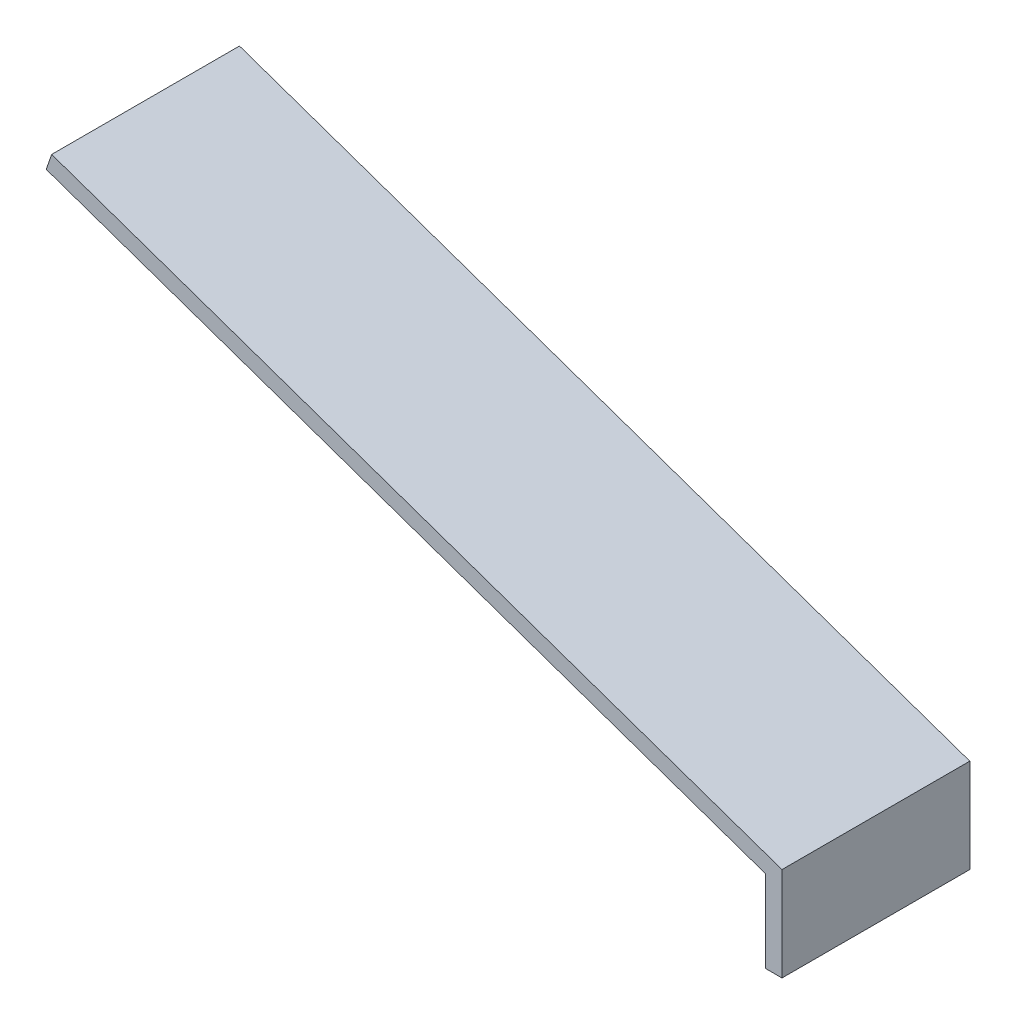
ISO-10303-21;
HEADER;
FILE_DESCRIPTION(('STEP AP214'),'2;1');
FILE_NAME('part.step','',(''),(''),'','','');
FILE_SCHEMA(('AUTOMOTIVE_DESIGN { 1 0 10303 214 1 1 1 1 }'));
ENDSEC;
DATA;
#1=APPLICATION_CONTEXT('core data for automotive mechanical design processes');
#2=APPLICATION_PROTOCOL_DEFINITION('international standard','automotive_design',2000,#1);
#3=PRODUCT_CONTEXT('',#1,'mechanical');
#4=PRODUCT('Part','Part','',(#3));
#5=PRODUCT_RELATED_PRODUCT_CATEGORY('part','',(#4));
#6=PRODUCT_DEFINITION_FORMATION('','',#4);
#7=PRODUCT_DEFINITION_CONTEXT('part definition',#1,'design');
#8=PRODUCT_DEFINITION('design','',#6,#7);
#9=PRODUCT_DEFINITION_SHAPE('','',#8);
#10=(LENGTH_UNIT() NAMED_UNIT(*) SI_UNIT(.MILLI.,.METRE.));
#11=(NAMED_UNIT(*) PLANE_ANGLE_UNIT() SI_UNIT($,.RADIAN.));
#12=(NAMED_UNIT(*) SI_UNIT($,.STERADIAN.) SOLID_ANGLE_UNIT());
#13=UNCERTAINTY_MEASURE_WITH_UNIT(LENGTH_MEASURE(1.E-05),#10,'distance_accuracy_value','');
#14=(GEOMETRIC_REPRESENTATION_CONTEXT(3) GLOBAL_UNCERTAINTY_ASSIGNED_CONTEXT((#13)) GLOBAL_UNIT_ASSIGNED_CONTEXT((#10,
#11,#12)) REPRESENTATION_CONTEXT('',''));
#15=CARTESIAN_POINT('',(0.,0.,0.));
#16=DIRECTION('',(0.,0.,1.));
#17=DIRECTION('',(1.,0.,0.));
#18=AXIS2_PLACEMENT_3D('',#15,#16,#17);
#19=CARTESIAN_POINT('',(0.,0.,2.1));
#20=DIRECTION('',(0.,-1.,0.));
#21=DIRECTION('',(0.,0.,-1.));
#22=AXIS2_PLACEMENT_3D('',#19,#20,#21);
#23=PLANE('',#22);
#24=DIRECTION('',(-1.,0.,0.));
#25=VECTOR('',#24,1.);
#26=CARTESIAN_POINT('',(0.,0.,-1.7000000000001));
#27=LINE('',#26,#25);
#28=CARTESIAN_POINT('',(0.300000000000014,0.,-1.7000000000001));
#29=VERTEX_POINT('',#28);
#30=CARTESIAN_POINT('',(0.,0.,-1.7000000000001));
#31=VERTEX_POINT('',#30);
#32=EDGE_CURVE('E34',#29,#31,#27,.T.);
#33=ORIENTED_EDGE('',*,*,#32,.F.);
#34=DIRECTION('',(0.,0.,-1.));
#35=VECTOR('',#34,1.);
#36=CARTESIAN_POINT('',(0.299999999999986,0.,2.1));
#37=LINE('',#36,#35);
#38=CARTESIAN_POINT('',(0.300000000000014,0.,1.69999999999989));
#39=VERTEX_POINT('',#38);
#40=EDGE_CURVE('E108',#39,#29,#37,.T.);
#41=ORIENTED_EDGE('',*,*,#40,.F.);
#42=DIRECTION('',(1.,0.,0.));
#43=VECTOR('',#42,1.);
#44=CARTESIAN_POINT('',(0.,0.,1.69999999999989));
#45=LINE('',#44,#43);
#46=CARTESIAN_POINT('',(0.,0.,1.69999999999989));
#47=VERTEX_POINT('',#46);
#48=EDGE_CURVE('E125',#47,#39,#45,.T.);
#49=ORIENTED_EDGE('',*,*,#48,.F.);
#50=DIRECTION('',(0.,0.,-1.));
#51=VECTOR('',#50,1.);
#52=CARTESIAN_POINT('',(0.,0.,2.1));
#53=LINE('',#52,#51);
#54=EDGE_CURVE('E100',#47,#31,#53,.T.);
#55=ORIENTED_EDGE('',*,*,#54,.T.);
#56=EDGE_LOOP('',(#33,#41,#49,#55));
#57=FACE_BOUND('',#56,.T.);
#58=ADVANCED_FACE('F19',(#57),#23,.T.);
#59=CARTESIAN_POINT('',(0.299999999999986,1.7,2.1));
#60=DIRECTION('',(1.,0.,0.));
#61=DIRECTION('',(0.,0.,-1.));
#62=AXIS2_PLACEMENT_3D('',#59,#60,#61);
#63=PLANE('',#62);
#64=DIRECTION('',(0.,-1.,0.));
#65=VECTOR('',#64,1.);
#66=CARTESIAN_POINT('',(0.300000000000012,1.7,-1.7000000000001));
#67=LINE('',#66,#65);
#68=CARTESIAN_POINT('',(0.300000000000012,1.7,-1.7000000000001));
#69=VERTEX_POINT('',#68);
#70=EDGE_CURVE('E137',#69,#29,#67,.T.);
#71=ORIENTED_EDGE('',*,*,#70,.F.);
#72=DIRECTION('',(0.,0.,-1.));
#73=VECTOR('',#72,1.);
#74=CARTESIAN_POINT('',(0.299999999999986,1.7,2.1));
#75=LINE('',#74,#73);
#76=CARTESIAN_POINT('',(0.299999999999988,1.7,1.6999999999999));
#77=VERTEX_POINT('',#76);
#78=EDGE_CURVE('E98',#77,#69,#75,.T.);
#79=ORIENTED_EDGE('',*,*,#78,.F.);
#80=DIRECTION('',(0.,1.,0.));
#81=VECTOR('',#80,1.);
#82=CARTESIAN_POINT('',(0.299999999999988,1.7,1.6999999999999));
#83=LINE('',#82,#81);
#84=EDGE_CURVE('E122',#39,#77,#83,.T.);
#85=ORIENTED_EDGE('',*,*,#84,.F.);
#86=ORIENTED_EDGE('',*,*,#40,.T.);
#87=EDGE_LOOP('',(#71,#79,#85,#86));
#88=FACE_BOUND('',#87,.T.);
#89=ADVANCED_FACE('F164',(#88),#63,.T.);
#90=CARTESIAN_POINT('',(-12.9220725547592,6.30182543744157,2.09999999999991));
#91=DIRECTION('',(0.328701816960112,0.944433753911369,0.));
#92=DIRECTION('',(-0.944433753911369,0.328701816960112,0.));
#93=AXIS2_PLACEMENT_3D('',#90,#91,#92);
#94=PLANE('',#93);
#95=DIRECTION('',(0.944433753911369,-0.328701816960112,0.));
#96=VECTOR('',#95,1.);
#97=CARTESIAN_POINT('',(-12.9220725547592,6.30182543744158,-1.70000000000009));
#98=LINE('',#97,#96);
#99=CARTESIAN_POINT('',(-12.9220725547592,6.30182543744158,-1.70000000000009));
#100=VERTEX_POINT('',#99);
#101=EDGE_CURVE('E133',#100,#69,#98,.T.);
#102=ORIENTED_EDGE('',*,*,#101,.F.);
#103=DIRECTION('',(0.,0.,-1.));
#104=VECTOR('',#103,1.);
#105=CARTESIAN_POINT('',(-12.9220725547592,6.30182543744157,2.09999999999991));
#106=LINE('',#105,#104);
#107=CARTESIAN_POINT('',(-12.9220725547592,6.30182543744157,1.69999999999991));
#108=VERTEX_POINT('',#107);
#109=EDGE_CURVE('E88',#108,#100,#106,.T.);
#110=ORIENTED_EDGE('',*,*,#109,.F.);
#111=DIRECTION('',(-0.944433753911369,0.328701816960112,0.));
#112=VECTOR('',#111,1.);
#113=CARTESIAN_POINT('',(-12.9220725547592,6.30182543744157,1.69999999999991));
#114=LINE('',#113,#112);
#115=EDGE_CURVE('E106',#77,#108,#114,.T.);
#116=ORIENTED_EDGE('',*,*,#115,.F.);
#117=ORIENTED_EDGE('',*,*,#78,.T.);
#118=EDGE_LOOP('',(#102,#110,#116,#117));
#119=FACE_BOUND('',#118,.T.);
#120=ADVANCED_FACE('F167',(#119),#94,.T.);
#121=CARTESIAN_POINT('',(-13.0206830998472,6.01849531126816,2.09999999999991));
#122=DIRECTION('',(-0.944433753911369,0.328701816960113,0.));
#123=DIRECTION('',(-0.328701816960113,-0.944433753911369,0.));
#124=AXIS2_PLACEMENT_3D('',#121,#122,#123);
#125=PLANE('',#124);
#126=DIRECTION('',(0.328701816960112,0.944433753911369,0.));
#127=VECTOR('',#126,1.);
#128=CARTESIAN_POINT('',(-16.7678838131925,-4.74804948332144,-1.70000000000011));
#129=LINE('',#128,#127);
#130=CARTESIAN_POINT('',(-13.0206830998472,6.01849531126817,-1.70000000000009));
#131=VERTEX_POINT('',#130);
#132=EDGE_CURVE('E73',#131,#100,#129,.T.);
#133=ORIENTED_EDGE('',*,*,#132,.F.);
#134=DIRECTION('',(0.,0.,-1.));
#135=VECTOR('',#134,1.);
#136=CARTESIAN_POINT('',(-13.0206830998472,6.01849531126816,2.09999999999991));
#137=LINE('',#136,#135);
#138=CARTESIAN_POINT('',(-13.0206830998472,6.01849531126816,1.69999999999991));
#139=VERTEX_POINT('',#138);
#140=EDGE_CURVE('E86',#139,#131,#137,.T.);
#141=ORIENTED_EDGE('',*,*,#140,.F.);
#142=DIRECTION('',(0.328701816960112,0.944433753911369,0.));
#143=VECTOR('',#142,1.);
#144=CARTESIAN_POINT('',(-16.7678838131925,-4.74804948332145,1.69999999999988));
#145=LINE('',#144,#143);
#146=EDGE_CURVE('E130',#139,#108,#145,.T.);
#147=ORIENTED_EDGE('',*,*,#146,.T.);
#148=ORIENTED_EDGE('',*,*,#109,.T.);
#149=EDGE_LOOP('',(#133,#141,#147,#148));
#150=FACE_BOUND('',#149,.T.);
#151=ADVANCED_FACE('F84',(#150),#125,.T.);
#152=CARTESIAN_POINT('',(0.,1.48676169283667,2.1));
#153=DIRECTION('',(-0.328701816960112,-0.944433753911369,0.));
#154=DIRECTION('',(0.944433753911369,-0.328701816960112,0.));
#155=AXIS2_PLACEMENT_3D('',#152,#153,#154);
#156=PLANE('',#155);
#157=DIRECTION('',(-0.944433753911369,0.328701816960112,0.));
#158=VECTOR('',#157,1.);
#159=CARTESIAN_POINT('',(0.,1.48676169283668,-1.7000000000001));
#160=LINE('',#159,#158);
#161=CARTESIAN_POINT('',(0.,1.48676169283667,-1.7000000000001));
#162=VERTEX_POINT('',#161);
#163=EDGE_CURVE('E70',#162,#131,#160,.T.);
#164=ORIENTED_EDGE('',*,*,#163,.F.);
#165=DIRECTION('',(0.,0.,-1.));
#166=VECTOR('',#165,1.);
#167=CARTESIAN_POINT('',(0.,1.48676169283667,2.1));
#168=LINE('',#167,#166);
#169=CARTESIAN_POINT('',(0.,1.48676169283667,1.6999999999999));
#170=VERTEX_POINT('',#169);
#171=EDGE_CURVE('E93',#170,#162,#168,.T.);
#172=ORIENTED_EDGE('',*,*,#171,.F.);
#173=DIRECTION('',(0.944433753911369,-0.328701816960112,0.));
#174=VECTOR('',#173,1.);
#175=CARTESIAN_POINT('',(0.,1.48676169283667,1.6999999999999));
#176=LINE('',#175,#174);
#177=EDGE_CURVE('E42',#139,#170,#176,.T.);
#178=ORIENTED_EDGE('',*,*,#177,.F.);
#179=ORIENTED_EDGE('',*,*,#140,.T.);
#180=EDGE_LOOP('',(#164,#172,#178,#179));
#181=FACE_BOUND('',#180,.T.);
#182=ADVANCED_FACE('F91',(#181),#156,.T.);
#183=CARTESIAN_POINT('',(0.,1.48676169283667,2.1));
#184=DIRECTION('',(-1.,0.,0.));
#185=DIRECTION('',(0.,0.,1.));
#186=AXIS2_PLACEMENT_3D('',#183,#184,#185);
#187=PLANE('',#186);
#188=DIRECTION('',(0.,1.,0.));
#189=VECTOR('',#188,1.);
#190=CARTESIAN_POINT('',(0.,1.48676169283668,-1.7000000000001));
#191=LINE('',#190,#189);
#192=EDGE_CURVE('E12',#31,#162,#191,.T.);
#193=ORIENTED_EDGE('',*,*,#192,.F.);
#194=ORIENTED_EDGE('',*,*,#54,.F.);
#195=DIRECTION('',(0.,-1.,0.));
#196=VECTOR('',#195,1.);
#197=CARTESIAN_POINT('',(0.,1.48676169283667,1.6999999999999));
#198=LINE('',#197,#196);
#199=EDGE_CURVE('E28',#170,#47,#198,.T.);
#200=ORIENTED_EDGE('',*,*,#199,.F.);
#201=ORIENTED_EDGE('',*,*,#171,.T.);
#202=EDGE_LOOP('',(#193,#194,#200,#201));
#203=FACE_BOUND('',#202,.T.);
#204=ADVANCED_FACE('F154',(#203),#187,.T.);
#205=CARTESIAN_POINT('',(-16.7678838131925,-4.74804948332145,1.69999999999988));
#206=DIRECTION('',(0.,0.,-1.));
#207=DIRECTION('',(0.,1.,0.));
#208=AXIS2_PLACEMENT_3D('',#205,#206,#207);
#209=PLANE('',#208);
#210=ORIENTED_EDGE('',*,*,#115,.T.);
#211=ORIENTED_EDGE('',*,*,#146,.F.);
#212=ORIENTED_EDGE('',*,*,#177,.T.);
#213=ORIENTED_EDGE('',*,*,#199,.T.);
#214=ORIENTED_EDGE('',*,*,#48,.T.);
#215=ORIENTED_EDGE('',*,*,#84,.T.);
#216=EDGE_LOOP('',(#210,#211,#212,#213,#214,#215));
#217=FACE_BOUND('',#216,.T.);
#218=ADVANCED_FACE('F156',(#217),#209,.F.);
#219=CARTESIAN_POINT('',(-16.7678838131925,-4.74804948332144,-1.70000000000011));
#220=DIRECTION('',(0.,0.,1.));
#221=DIRECTION('',(0.,-1.,0.));
#222=AXIS2_PLACEMENT_3D('',#219,#220,#221);
#223=PLANE('',#222);
#224=ORIENTED_EDGE('',*,*,#101,.T.);
#225=ORIENTED_EDGE('',*,*,#70,.T.);
#226=ORIENTED_EDGE('',*,*,#32,.T.);
#227=ORIENTED_EDGE('',*,*,#192,.T.);
#228=ORIENTED_EDGE('',*,*,#163,.T.);
#229=ORIENTED_EDGE('',*,*,#132,.T.);
#230=EDGE_LOOP('',(#224,#225,#226,#227,#228,#229));
#231=FACE_BOUND('',#230,.T.);
#232=ADVANCED_FACE('F72',(#231),#223,.F.);
#233=CLOSED_SHELL('',(#58,#89,#120,#151,#182,#204,#218,#232));
#234=MANIFOLD_SOLID_BREP('B1',#233);
#235=ADVANCED_BREP_SHAPE_REPRESENTATION('',(#18,#234),#14);
#236=SHAPE_DEFINITION_REPRESENTATION(#9,#235);
ENDSEC;
END-ISO-10303-21;
